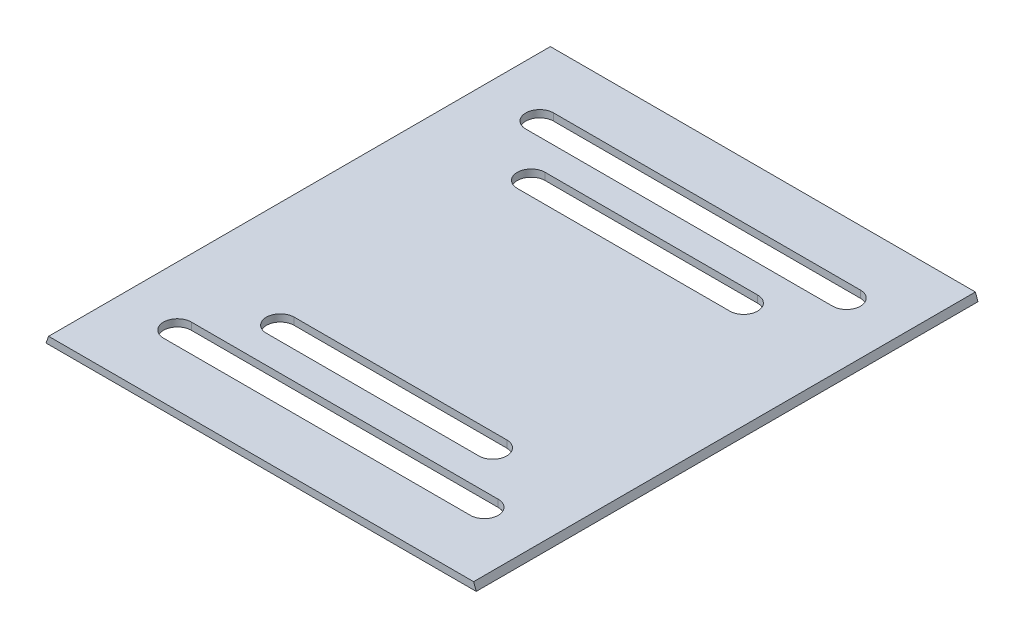
ISO-10303-21;
HEADER;
FILE_DESCRIPTION(('STEP AP214'),'2;1');
FILE_NAME('part.step','',(''),(''),'','','');
FILE_SCHEMA(('AUTOMOTIVE_DESIGN { 1 0 10303 214 1 1 1 1 }'));
ENDSEC;
DATA;
#1=APPLICATION_CONTEXT('core data for automotive mechanical design processes');
#2=APPLICATION_PROTOCOL_DEFINITION('international standard','automotive_design',2000,#1);
#3=PRODUCT_CONTEXT('',#1,'mechanical');
#4=PRODUCT('Part','Part','',(#3));
#5=PRODUCT_RELATED_PRODUCT_CATEGORY('part','',(#4));
#6=PRODUCT_DEFINITION_FORMATION('','',#4);
#7=PRODUCT_DEFINITION_CONTEXT('part definition',#1,'design');
#8=PRODUCT_DEFINITION('design','',#6,#7);
#9=PRODUCT_DEFINITION_SHAPE('','',#8);
#10=(LENGTH_UNIT() NAMED_UNIT(*) SI_UNIT(.MILLI.,.METRE.));
#11=(NAMED_UNIT(*) PLANE_ANGLE_UNIT() SI_UNIT($,.RADIAN.));
#12=(NAMED_UNIT(*) SI_UNIT($,.STERADIAN.) SOLID_ANGLE_UNIT());
#13=UNCERTAINTY_MEASURE_WITH_UNIT(LENGTH_MEASURE(1.E-05),#10,'distance_accuracy_value','');
#14=(GEOMETRIC_REPRESENTATION_CONTEXT(3) GLOBAL_UNCERTAINTY_ASSIGNED_CONTEXT((#13)) GLOBAL_UNIT_ASSIGNED_CONTEXT((#10,
#11,#12)) REPRESENTATION_CONTEXT('',''));
#15=CARTESIAN_POINT('',(0.,0.,0.));
#16=DIRECTION('',(0.,0.,1.));
#17=DIRECTION('',(1.,0.,0.));
#18=AXIS2_PLACEMENT_3D('',#15,#16,#17);
#19=CARTESIAN_POINT('',(-79.7671903582999,0.303723348595497,-180.));
#20=DIRECTION('',(0.,1.,0.));
#21=DIRECTION('',(-1.,0.,0.));
#22=AXIS2_PLACEMENT_3D('',#19,#20,#21);
#23=PLANE('',#22);
#24=CARTESIAN_POINT('',(51.5038134634531,0.303723348595498,-154.975433947444));
#25=DIRECTION('',(0.,1.,0.));
#26=DIRECTION('',(1.,0.,0.));
#27=AXIS2_PLACEMENT_3D('',#24,#25,#26);
#28=CIRCLE('',#27,5.);
#29=CARTESIAN_POINT('',(51.5038134634531,0.303723348595498,-149.975433947444));
#30=VERTEX_POINT('',#29);
#31=CARTESIAN_POINT('',(51.5038134634531,0.303723348595498,-159.975433947444));
#32=VERTEX_POINT('',#31);
#33=EDGE_CURVE('E55',#30,#32,#28,.T.);
#34=ORIENTED_EDGE('',*,*,#33,.F.);
#35=DIRECTION('',(1.,0.,0.));
#36=VECTOR('',#35,1.);
#37=CARTESIAN_POINT('',(-56.9956232695823,0.303723348595498,-149.975433947444));
#38=LINE('',#37,#36);
#39=CARTESIAN_POINT('',(-58.5702830662908,0.303723348595497,-149.975433947444));
#40=VERTEX_POINT('',#39);
#41=EDGE_CURVE('E199',#40,#30,#38,.T.);
#42=ORIENTED_EDGE('',*,*,#41,.F.);
#43=CARTESIAN_POINT('',(-58.5702830662908,0.303723348595497,-154.975433947444));
#44=DIRECTION('',(0.,1.,0.));
#45=DIRECTION('',(1.,0.,0.));
#46=AXIS2_PLACEMENT_3D('',#43,#44,#45);
#47=CIRCLE('',#46,5.);
#48=CARTESIAN_POINT('',(-58.5702830662908,0.303723348595497,-159.975433947444));
#49=VERTEX_POINT('',#48);
#50=EDGE_CURVE('E183',#49,#40,#47,.T.);
#51=ORIENTED_EDGE('',*,*,#50,.F.);
#52=DIRECTION('',(-1.,0.,0.));
#53=VECTOR('',#52,1.);
#54=CARTESIAN_POINT('',(-58.5702830662908,0.303723348595497,-159.975433947444));
#55=LINE('',#54,#53);
#56=EDGE_CURVE('E193',#32,#49,#55,.T.);
#57=ORIENTED_EDGE('',*,*,#56,.F.);
#58=EDGE_LOOP('',(#34,#42,#51,#57));
#59=FACE_BOUND('',#58,.T.);
#60=CARTESIAN_POINT('',(-41.6502125798594,0.303723348595498,-45.));
#61=DIRECTION('',(0.,1.,0.));
#62=DIRECTION('',(-1.,0.,0.));
#63=AXIS2_PLACEMENT_3D('',#60,#61,#62);
#64=CIRCLE('',#63,5.);
#65=CARTESIAN_POINT('',(-41.6502125798594,0.303723348595498,-50.));
#66=VERTEX_POINT('',#65);
#67=CARTESIAN_POINT('',(-41.6502125798594,0.303723348595498,-40.));
#68=VERTEX_POINT('',#67);
#69=EDGE_CURVE('E63',#66,#68,#64,.T.);
#70=ORIENTED_EDGE('',*,*,#69,.F.);
#71=DIRECTION('',(-1.,0.,0.));
#72=VECTOR('',#71,1.);
#73=CARTESIAN_POINT('',(-41.6502125798594,0.303723348595498,-50.));
#74=LINE('',#73,#72);
#75=CARTESIAN_POINT('',(34.5837429770217,0.303723348595498,-50.));
#76=VERTEX_POINT('',#75);
#77=EDGE_CURVE('E217',#76,#66,#74,.T.);
#78=ORIENTED_EDGE('',*,*,#77,.F.);
#79=CARTESIAN_POINT('',(34.5837429770217,0.303723348595498,-45.));
#80=DIRECTION('',(0.,1.,0.));
#81=DIRECTION('',(-1.,0.,0.));
#82=AXIS2_PLACEMENT_3D('',#79,#80,#81);
#83=CIRCLE('',#82,5.);
#84=CARTESIAN_POINT('',(34.5837429770217,0.303723348595498,-40.));
#85=VERTEX_POINT('',#84);
#86=EDGE_CURVE('E214',#85,#76,#83,.T.);
#87=ORIENTED_EDGE('',*,*,#86,.F.);
#88=DIRECTION('',(1.,0.,0.));
#89=VECTOR('',#88,1.);
#90=CARTESIAN_POINT('',(-41.6502125798594,0.303723348595498,-40.));
#91=LINE('',#90,#89);
#92=EDGE_CURVE('E210',#68,#85,#91,.T.);
#93=ORIENTED_EDGE('',*,*,#92,.F.);
#94=EDGE_LOOP('',(#70,#78,#87,#93));
#95=FACE_BOUND('',#94,.T.);
#96=DIRECTION('',(-1.,0.,0.));
#97=VECTOR('',#96,1.);
#98=CARTESIAN_POINT('',(-56.9956232695823,0.303723348595498,-30.0245660525564));
#99=LINE('',#98,#97);
#100=CARTESIAN_POINT('',(51.5038134634531,0.303723348595498,-30.0245660525564));
#101=VERTEX_POINT('',#100);
#102=CARTESIAN_POINT('',(-58.5702830662908,0.303723348595498,-30.0245660525564));
#103=VERTEX_POINT('',#102);
#104=EDGE_CURVE('E238',#101,#103,#99,.T.);
#105=ORIENTED_EDGE('',*,*,#104,.F.);
#106=CARTESIAN_POINT('',(51.5038134634531,0.303723348595498,-25.0245660525564));
#107=DIRECTION('',(0.,1.,0.));
#108=DIRECTION('',(-1.,0.,0.));
#109=AXIS2_PLACEMENT_3D('',#106,#107,#108);
#110=CIRCLE('',#109,5.);
#111=CARTESIAN_POINT('',(51.5038134634531,0.303723348595498,-20.0245660525564));
#112=VERTEX_POINT('',#111);
#113=EDGE_CURVE('E235',#112,#101,#110,.T.);
#114=ORIENTED_EDGE('',*,*,#113,.F.);
#115=DIRECTION('',(1.,0.,0.));
#116=VECTOR('',#115,1.);
#117=CARTESIAN_POINT('',(-58.5702830662908,0.303723348595497,-20.0245660525564));
#118=LINE('',#117,#116);
#119=CARTESIAN_POINT('',(-58.5702830662908,0.303723348595497,-20.0245660525564));
#120=VERTEX_POINT('',#119);
#121=EDGE_CURVE('E231',#120,#112,#118,.T.);
#122=ORIENTED_EDGE('',*,*,#121,.F.);
#123=CARTESIAN_POINT('',(-58.5702830662908,0.303723348595497,-25.0245660525564));
#124=DIRECTION('',(0.,1.,0.));
#125=DIRECTION('',(-1.,0.,0.));
#126=AXIS2_PLACEMENT_3D('',#123,#124,#125);
#127=CIRCLE('',#126,5.);
#128=EDGE_CURVE('E228',#103,#120,#127,.T.);
#129=ORIENTED_EDGE('',*,*,#128,.F.);
#130=EDGE_LOOP('',(#105,#114,#122,#129));
#131=FACE_BOUND('',#130,.T.);
#132=CARTESIAN_POINT('',(34.5837429770217,0.303723348595498,-135.));
#133=DIRECTION('',(0.,1.,0.));
#134=DIRECTION('',(1.,0.,0.));
#135=AXIS2_PLACEMENT_3D('',#132,#133,#134);
#136=CIRCLE('',#135,5.);
#137=CARTESIAN_POINT('',(34.5837429770217,0.303723348595498,-130.));
#138=VERTEX_POINT('',#137);
#139=CARTESIAN_POINT('',(34.5837429770217,0.303723348595498,-140.));
#140=VERTEX_POINT('',#139);
#141=EDGE_CURVE('E248',#138,#140,#136,.T.);
#142=ORIENTED_EDGE('',*,*,#141,.F.);
#143=DIRECTION('',(1.,0.,0.));
#144=VECTOR('',#143,1.);
#145=CARTESIAN_POINT('',(-41.6502125798594,0.303723348595498,-130.));
#146=LINE('',#145,#144);
#147=CARTESIAN_POINT('',(-41.6502125798594,0.303723348595498,-130.));
#148=VERTEX_POINT('',#147);
#149=EDGE_CURVE('E256',#148,#138,#146,.T.);
#150=ORIENTED_EDGE('',*,*,#149,.F.);
#151=CARTESIAN_POINT('',(-41.6502125798594,0.303723348595498,-135.));
#152=DIRECTION('',(0.,1.,0.));
#153=DIRECTION('',(1.,0.,0.));
#154=AXIS2_PLACEMENT_3D('',#151,#152,#153);
#155=CIRCLE('',#154,4.99999999999999);
#156=CARTESIAN_POINT('',(-41.6502125798594,0.303723348595498,-140.));
#157=VERTEX_POINT('',#156);
#158=EDGE_CURVE('E253',#157,#148,#155,.T.);
#159=ORIENTED_EDGE('',*,*,#158,.F.);
#160=DIRECTION('',(-1.,0.,0.));
#161=VECTOR('',#160,1.);
#162=CARTESIAN_POINT('',(-41.6502125798594,0.303723348595498,-140.));
#163=LINE('',#162,#161);
#164=EDGE_CURVE('E250',#140,#157,#163,.T.);
#165=ORIENTED_EDGE('',*,*,#164,.F.);
#166=EDGE_LOOP('',(#142,#150,#159,#165));
#167=FACE_BOUND('',#166,.T.);
#168=DIRECTION('',(-1.,0.,0.));
#169=VECTOR('',#168,1.);
#170=CARTESIAN_POINT('',(-79.7671903582999,0.303723348595497,0.));
#171=LINE('',#170,#169);
#172=CARTESIAN_POINT('',(72.7007207554622,0.303723348595498,0.));
#173=VERTEX_POINT('',#172);
#174=CARTESIAN_POINT('',(-79.7671903582999,0.303723348595497,0.));
#175=VERTEX_POINT('',#174);
#176=EDGE_CURVE('E270',#173,#175,#171,.T.);
#177=ORIENTED_EDGE('',*,*,#176,.F.);
#178=DIRECTION('',(0.,0.,1.));
#179=VECTOR('',#178,1.);
#180=CARTESIAN_POINT('',(72.7007207554622,0.303723348595498,-180.));
#181=LINE('',#180,#179);
#182=CARTESIAN_POINT('',(72.7007207554622,0.303723348595498,-180.));
#183=VERTEX_POINT('',#182);
#184=EDGE_CURVE('E292',#183,#173,#181,.T.);
#185=ORIENTED_EDGE('',*,*,#184,.F.);
#186=DIRECTION('',(-1.,0.,0.));
#187=VECTOR('',#186,1.);
#188=CARTESIAN_POINT('',(72.7007207554622,0.303723348595498,-180.));
#189=LINE('',#188,#187);
#190=CARTESIAN_POINT('',(-79.7671903582999,0.303723348595497,-180.));
#191=VERTEX_POINT('',#190);
#192=EDGE_CURVE('E275',#183,#191,#189,.T.);
#193=ORIENTED_EDGE('',*,*,#192,.T.);
#194=DIRECTION('',(0.,0.,1.));
#195=VECTOR('',#194,1.);
#196=CARTESIAN_POINT('',(-79.7671903582999,0.303723348595497,-180.));
#197=LINE('',#196,#195);
#198=EDGE_CURVE('E288',#191,#175,#197,.T.);
#199=ORIENTED_EDGE('',*,*,#198,.T.);
#200=EDGE_LOOP('',(#177,#185,#193,#199));
#201=FACE_BOUND('',#200,.T.);
#202=ADVANCED_FACE('F40',(#59,#95,#131,#167,#201),#23,.T.);
#203=CARTESIAN_POINT('',(72.7318420433847,0.218218312764078,-180.));
#204=DIRECTION('',(0.939692620785915,0.34202014332565,0.));
#205=DIRECTION('',(-0.34202014332565,0.939692620785915,0.));
#206=AXIS2_PLACEMENT_3D('',#203,#204,#205);
#207=PLANE('',#206);
#208=DIRECTION('',(-0.34202014332565,0.939692620785915,0.));
#209=VECTOR('',#208,1.);
#210=CARTESIAN_POINT('',(72.7318420433847,0.218218312764078,0.));
#211=LINE('',#210,#209);
#212=CARTESIAN_POINT('',(73.6357886268726,-2.26535451376221,0.));
#213=VERTEX_POINT('',#212);
#214=EDGE_CURVE('E283',#213,#173,#211,.T.);
#215=ORIENTED_EDGE('',*,*,#214,.F.);
#216=DIRECTION('',(0.,0.,1.));
#217=VECTOR('',#216,1.);
#218=CARTESIAN_POINT('',(73.6357886268726,-2.26535451376221,-180.));
#219=LINE('',#218,#217);
#220=CARTESIAN_POINT('',(73.6357886268726,-2.26535451376221,-180.));
#221=VERTEX_POINT('',#220);
#222=EDGE_CURVE('E295',#221,#213,#219,.T.);
#223=ORIENTED_EDGE('',*,*,#222,.F.);
#224=DIRECTION('',(-0.342020143325681,0.939692620785904,0.));
#225=VECTOR('',#224,1.);
#226=CARTESIAN_POINT('',(73.6357886268726,-2.26535451376221,-180.));
#227=LINE('',#226,#225);
#228=EDGE_CURVE('E273',#221,#183,#227,.T.);
#229=ORIENTED_EDGE('',*,*,#228,.T.);
#230=ORIENTED_EDGE('',*,*,#184,.T.);
#231=EDGE_LOOP('',(#215,#223,#229,#230));
#232=FACE_BOUND('',#231,.T.);
#233=ADVANCED_FACE('F350',(#232),#207,.T.);
#234=CARTESIAN_POINT('',(-80.7022582297104,-2.26535451376221,-180.));
#235=DIRECTION('',(0.,-1.,0.));
#236=DIRECTION('',(0.,0.,-1.));
#237=AXIS2_PLACEMENT_3D('',#234,#235,#236);
#238=PLANE('',#237);
#239=CARTESIAN_POINT('',(51.5038134634531,-2.26535451376221,-154.975433947444));
#240=DIRECTION('',(0.,-1.,0.));
#241=DIRECTION('',(0.,0.,-1.));
#242=AXIS2_PLACEMENT_3D('',#239,#240,#241);
#243=CIRCLE('',#242,5.);
#244=CARTESIAN_POINT('',(51.5038134634531,-2.26535451376221,-159.975433947444));
#245=VERTEX_POINT('',#244);
#246=CARTESIAN_POINT('',(51.5038134634531,-2.26535451376221,-149.975433947444));
#247=VERTEX_POINT('',#246);
#248=EDGE_CURVE('E11',#245,#247,#243,.T.);
#249=ORIENTED_EDGE('',*,*,#248,.F.);
#250=DIRECTION('',(1.,0.,0.));
#251=VECTOR('',#250,1.);
#252=CARTESIAN_POINT('',(-80.7022582297104,-2.26535451376221,-159.975433947444));
#253=LINE('',#252,#251);
#254=CARTESIAN_POINT('',(-58.5702830662908,-2.26535451376221,-159.975433947444));
#255=VERTEX_POINT('',#254);
#256=EDGE_CURVE('E325',#255,#245,#253,.T.);
#257=ORIENTED_EDGE('',*,*,#256,.F.);
#258=CARTESIAN_POINT('',(-58.5702830662908,-2.26535451376221,-154.975433947444));
#259=DIRECTION('',(0.,-1.,0.));
#260=DIRECTION('',(0.,0.,-1.));
#261=AXIS2_PLACEMENT_3D('',#258,#259,#260);
#262=CIRCLE('',#261,5.);
#263=CARTESIAN_POINT('',(-58.5702830662908,-2.26535451376221,-149.975433947444));
#264=VERTEX_POINT('',#263);
#265=EDGE_CURVE('E186',#264,#255,#262,.T.);
#266=ORIENTED_EDGE('',*,*,#265,.F.);
#267=DIRECTION('',(-1.,0.,0.));
#268=VECTOR('',#267,1.);
#269=CARTESIAN_POINT('',(-80.7022582297104,-2.26535451376221,-149.975433947444));
#270=LINE('',#269,#268);
#271=EDGE_CURVE('E48',#247,#264,#270,.T.);
#272=ORIENTED_EDGE('',*,*,#271,.F.);
#273=EDGE_LOOP('',(#249,#257,#266,#272));
#274=FACE_BOUND('',#273,.T.);
#275=CARTESIAN_POINT('',(-41.6502125798594,-2.26535451376221,-45.));
#276=DIRECTION('',(0.,-1.,0.));
#277=DIRECTION('',(0.,0.,-1.));
#278=AXIS2_PLACEMENT_3D('',#275,#276,#277);
#279=CIRCLE('',#278,5.);
#280=CARTESIAN_POINT('',(-41.6502125798594,-2.26535451376221,-40.));
#281=VERTEX_POINT('',#280);
#282=CARTESIAN_POINT('',(-41.6502125798594,-2.26535451376221,-50.));
#283=VERTEX_POINT('',#282);
#284=EDGE_CURVE('E323',#281,#283,#279,.T.);
#285=ORIENTED_EDGE('',*,*,#284,.F.);
#286=DIRECTION('',(-1.,0.,0.));
#287=VECTOR('',#286,1.);
#288=CARTESIAN_POINT('',(-80.7022582297104,-2.26535451376221,-40.));
#289=LINE('',#288,#287);
#290=CARTESIAN_POINT('',(34.5837429770217,-2.26535451376221,-40.));
#291=VERTEX_POINT('',#290);
#292=EDGE_CURVE('E316',#291,#281,#289,.T.);
#293=ORIENTED_EDGE('',*,*,#292,.F.);
#294=CARTESIAN_POINT('',(34.5837429770217,-2.26535451376221,-45.));
#295=DIRECTION('',(0.,-1.,0.));
#296=DIRECTION('',(0.,0.,-1.));
#297=AXIS2_PLACEMENT_3D('',#294,#295,#296);
#298=CIRCLE('',#297,5.);
#299=CARTESIAN_POINT('',(34.5837429770217,-2.26535451376221,-50.));
#300=VERTEX_POINT('',#299);
#301=EDGE_CURVE('E318',#300,#291,#298,.T.);
#302=ORIENTED_EDGE('',*,*,#301,.F.);
#303=DIRECTION('',(1.,0.,0.));
#304=VECTOR('',#303,1.);
#305=CARTESIAN_POINT('',(-80.7022582297104,-2.26535451376221,-50.));
#306=LINE('',#305,#304);
#307=EDGE_CURVE('E321',#283,#300,#306,.T.);
#308=ORIENTED_EDGE('',*,*,#307,.F.);
#309=EDGE_LOOP('',(#285,#293,#302,#308));
#310=FACE_BOUND('',#309,.T.);
#311=DIRECTION('',(1.,0.,0.));
#312=VECTOR('',#311,1.);
#313=CARTESIAN_POINT('',(-80.7022582297104,-2.26535451376221,-30.0245660525564));
#314=LINE('',#313,#312);
#315=CARTESIAN_POINT('',(-58.5702830662908,-2.26535451376221,-30.0245660525564));
#316=VERTEX_POINT('',#315);
#317=CARTESIAN_POINT('',(51.5038134634531,-2.26535451376221,-30.0245660525564));
#318=VERTEX_POINT('',#317);
#319=EDGE_CURVE('E314',#316,#318,#314,.T.);
#320=ORIENTED_EDGE('',*,*,#319,.F.);
#321=CARTESIAN_POINT('',(-58.5702830662908,-2.26535451376221,-25.0245660525564));
#322=DIRECTION('',(0.,-1.,0.));
#323=DIRECTION('',(0.,0.,-1.));
#324=AXIS2_PLACEMENT_3D('',#321,#322,#323);
#325=CIRCLE('',#324,5.);
#326=CARTESIAN_POINT('',(-58.5702830662908,-2.26535451376221,-20.0245660525564));
#327=VERTEX_POINT('',#326);
#328=EDGE_CURVE('E307',#327,#316,#325,.T.);
#329=ORIENTED_EDGE('',*,*,#328,.F.);
#330=DIRECTION('',(-1.,0.,0.));
#331=VECTOR('',#330,1.);
#332=CARTESIAN_POINT('',(-80.7022582297104,-2.26535451376221,-20.0245660525564));
#333=LINE('',#332,#331);
#334=CARTESIAN_POINT('',(51.5038134634531,-2.26535451376221,-20.0245660525564));
#335=VERTEX_POINT('',#334);
#336=EDGE_CURVE('E309',#335,#327,#333,.T.);
#337=ORIENTED_EDGE('',*,*,#336,.F.);
#338=CARTESIAN_POINT('',(51.5038134634531,-2.26535451376221,-25.0245660525564));
#339=DIRECTION('',(0.,-1.,0.));
#340=DIRECTION('',(0.,0.,-1.));
#341=AXIS2_PLACEMENT_3D('',#338,#339,#340);
#342=CIRCLE('',#341,5.);
#343=EDGE_CURVE('E312',#318,#335,#342,.T.);
#344=ORIENTED_EDGE('',*,*,#343,.F.);
#345=EDGE_LOOP('',(#320,#329,#337,#344));
#346=FACE_BOUND('',#345,.T.);
#347=CARTESIAN_POINT('',(34.5837429770217,-2.26535451376221,-135.));
#348=DIRECTION('',(0.,-1.,0.));
#349=DIRECTION('',(0.,0.,-1.));
#350=AXIS2_PLACEMENT_3D('',#347,#348,#349);
#351=CIRCLE('',#350,5.);
#352=CARTESIAN_POINT('',(34.5837429770217,-2.26535451376221,-140.));
#353=VERTEX_POINT('',#352);
#354=CARTESIAN_POINT('',(34.5837429770217,-2.26535451376221,-130.));
#355=VERTEX_POINT('',#354);
#356=EDGE_CURVE('E305',#353,#355,#351,.T.);
#357=ORIENTED_EDGE('',*,*,#356,.F.);
#358=DIRECTION('',(1.,0.,0.));
#359=VECTOR('',#358,1.);
#360=CARTESIAN_POINT('',(-80.7022582297104,-2.26535451376221,-140.));
#361=LINE('',#360,#359);
#362=CARTESIAN_POINT('',(-41.6502125798594,-2.26535451376221,-140.));
#363=VERTEX_POINT('',#362);
#364=EDGE_CURVE('E291',#363,#353,#361,.T.);
#365=ORIENTED_EDGE('',*,*,#364,.F.);
#366=CARTESIAN_POINT('',(-41.6502125798594,-2.26535451376221,-135.));
#367=DIRECTION('',(0.,-1.,0.));
#368=DIRECTION('',(0.,0.,-1.));
#369=AXIS2_PLACEMENT_3D('',#366,#367,#368);
#370=CIRCLE('',#369,4.99999999999999);
#371=CARTESIAN_POINT('',(-41.6502125798594,-2.26535451376221,-130.));
#372=VERTEX_POINT('',#371);
#373=EDGE_CURVE('E300',#372,#363,#370,.T.);
#374=ORIENTED_EDGE('',*,*,#373,.F.);
#375=DIRECTION('',(-1.,0.,0.));
#376=VECTOR('',#375,1.);
#377=CARTESIAN_POINT('',(-80.7022582297104,-2.26535451376221,-130.));
#378=LINE('',#377,#376);
#379=EDGE_CURVE('E303',#355,#372,#378,.T.);
#380=ORIENTED_EDGE('',*,*,#379,.F.);
#381=EDGE_LOOP('',(#357,#365,#374,#380));
#382=FACE_BOUND('',#381,.T.);
#383=DIRECTION('',(1.,0.,0.));
#384=VECTOR('',#383,1.);
#385=CARTESIAN_POINT('',(-80.7022582297104,-2.26535451376221,0.));
#386=LINE('',#385,#384);
#387=CARTESIAN_POINT('',(-80.7022582297104,-2.26535451376221,0.));
#388=VERTEX_POINT('',#387);
#389=EDGE_CURVE('E280',#388,#213,#386,.T.);
#390=ORIENTED_EDGE('',*,*,#389,.F.);
#391=DIRECTION('',(0.,0.,1.));
#392=VECTOR('',#391,1.);
#393=CARTESIAN_POINT('',(-80.7022582297104,-2.26535451376221,-180.));
#394=LINE('',#393,#392);
#395=CARTESIAN_POINT('',(-80.7022582297104,-2.26535451376221,-180.));
#396=VERTEX_POINT('',#395);
#397=EDGE_CURVE('E277',#396,#388,#394,.T.);
#398=ORIENTED_EDGE('',*,*,#397,.F.);
#399=DIRECTION('',(1.,0.,0.));
#400=VECTOR('',#399,1.);
#401=CARTESIAN_POINT('',(-80.7022582297104,-2.26535451376221,-180.));
#402=LINE('',#401,#400);
#403=EDGE_CURVE('E269',#396,#221,#402,.T.);
#404=ORIENTED_EDGE('',*,*,#403,.T.);
#405=ORIENTED_EDGE('',*,*,#222,.T.);
#406=EDGE_LOOP('',(#390,#398,#404,#405));
#407=FACE_BOUND('',#406,.T.);
#408=ADVANCED_FACE('F333',(#274,#310,#346,#382,#407),#238,.T.);
#409=CARTESIAN_POINT('',(-79.7983116462224,0.218218312764078,-180.));
#410=DIRECTION('',(-0.939692620785904,0.342020143325681,0.));
#411=DIRECTION('',(-0.342020143325681,-0.939692620785904,0.));
#412=AXIS2_PLACEMENT_3D('',#409,#410,#411);
#413=PLANE('',#412);
#414=DIRECTION('',(-0.342020143325681,-0.939692620785904,0.));
#415=VECTOR('',#414,1.);
#416=CARTESIAN_POINT('',(-79.7983116462224,0.218218312764078,0.));
#417=LINE('',#416,#415);
#418=EDGE_CURVE('E206',#175,#388,#417,.T.);
#419=ORIENTED_EDGE('',*,*,#418,.F.);
#420=ORIENTED_EDGE('',*,*,#198,.F.);
#421=DIRECTION('',(-0.342020143325789,-0.939692620785865,0.));
#422=VECTOR('',#421,1.);
#423=CARTESIAN_POINT('',(-79.7983116462224,0.218218312764078,-180.));
#424=LINE('',#423,#422);
#425=EDGE_CURVE('E267',#191,#396,#424,.T.);
#426=ORIENTED_EDGE('',*,*,#425,.T.);
#427=ORIENTED_EDGE('',*,*,#397,.T.);
#428=EDGE_LOOP('',(#419,#420,#426,#427));
#429=FACE_BOUND('',#428,.T.);
#430=ADVANCED_FACE('F42',(#429),#413,.T.);
#431=CARTESIAN_POINT('',(0.,0.,-180.));
#432=DIRECTION('',(0.,0.,-1.));
#433=DIRECTION('',(-1.,0.,0.));
#434=AXIS2_PLACEMENT_3D('',#431,#432,#433);
#435=PLANE('',#434);
#436=ORIENTED_EDGE('',*,*,#425,.F.);
#437=ORIENTED_EDGE('',*,*,#192,.F.);
#438=ORIENTED_EDGE('',*,*,#228,.F.);
#439=ORIENTED_EDGE('',*,*,#403,.F.);
#440=EDGE_LOOP('',(#436,#437,#438,#439));
#441=FACE_BOUND('',#440,.T.);
#442=ADVANCED_FACE('F364',(#441),#435,.T.);
#443=CARTESIAN_POINT('',(0.,0.,0.));
#444=DIRECTION('',(0.,0.,-1.));
#445=DIRECTION('',(-1.,0.,0.));
#446=AXIS2_PLACEMENT_3D('',#443,#444,#445);
#447=PLANE('',#446);
#448=ORIENTED_EDGE('',*,*,#176,.T.);
#449=ORIENTED_EDGE('',*,*,#418,.T.);
#450=ORIENTED_EDGE('',*,*,#389,.T.);
#451=ORIENTED_EDGE('',*,*,#214,.T.);
#452=EDGE_LOOP('',(#448,#449,#450,#451));
#453=FACE_BOUND('',#452,.T.);
#454=ADVANCED_FACE('F358',(#453),#447,.F.);
#455=CARTESIAN_POINT('',(34.5837429770217,-2.6962766514045,-135.));
#456=DIRECTION('',(0.,1.,0.));
#457=DIRECTION('',(-1.,0.,0.));
#458=AXIS2_PLACEMENT_3D('',#455,#456,#457);
#459=CYLINDRICAL_SURFACE('',#458,5.);
#460=ORIENTED_EDGE('',*,*,#356,.T.);
#461=DIRECTION('',(0.,1.,0.));
#462=VECTOR('',#461,1.);
#463=CARTESIAN_POINT('',(34.5837429770217,-2.6962766514045,-130.));
#464=LINE('',#463,#462);
#465=EDGE_CURVE('E232',#355,#138,#464,.T.);
#466=ORIENTED_EDGE('',*,*,#465,.T.);
#467=ORIENTED_EDGE('',*,*,#141,.T.);
#468=DIRECTION('',(0.,1.,0.));
#469=VECTOR('',#468,1.);
#470=CARTESIAN_POINT('',(34.5837429770217,-2.6962766514045,-140.));
#471=LINE('',#470,#469);
#472=EDGE_CURVE('E259',#353,#140,#471,.T.);
#473=ORIENTED_EDGE('',*,*,#472,.F.);
#474=EDGE_LOOP('',(#460,#466,#467,#473));
#475=FACE_BOUND('',#474,.T.);
#476=ADVANCED_FACE('F382',(#475),#459,.F.);
#477=CARTESIAN_POINT('',(-41.6502125798594,-2.6962766514045,-130.));
#478=DIRECTION('',(0.,0.,1.));
#479=DIRECTION('',(1.,0.,0.));
#480=AXIS2_PLACEMENT_3D('',#477,#478,#479);
#481=PLANE('',#480);
#482=ORIENTED_EDGE('',*,*,#379,.T.);
#483=DIRECTION('',(0.,1.,0.));
#484=VECTOR('',#483,1.);
#485=CARTESIAN_POINT('',(-41.6502125798594,-2.6962766514045,-130.));
#486=LINE('',#485,#484);
#487=EDGE_CURVE('E261',#372,#148,#486,.T.);
#488=ORIENTED_EDGE('',*,*,#487,.T.);
#489=ORIENTED_EDGE('',*,*,#149,.T.);
#490=ORIENTED_EDGE('',*,*,#465,.F.);
#491=EDGE_LOOP('',(#482,#488,#489,#490));
#492=FACE_BOUND('',#491,.T.);
#493=ADVANCED_FACE('F386',(#492),#481,.F.);
#494=CARTESIAN_POINT('',(-41.6502125798594,-2.6962766514045,-135.));
#495=DIRECTION('',(0.,1.,0.));
#496=DIRECTION('',(-1.,0.,0.));
#497=AXIS2_PLACEMENT_3D('',#494,#495,#496);
#498=CYLINDRICAL_SURFACE('',#497,4.99999999999999);
#499=ORIENTED_EDGE('',*,*,#373,.T.);
#500=DIRECTION('',(0.,1.,0.));
#501=VECTOR('',#500,1.);
#502=CARTESIAN_POINT('',(-41.6502125798594,-2.6962766514045,-140.));
#503=LINE('',#502,#501);
#504=EDGE_CURVE('E263',#363,#157,#503,.T.);
#505=ORIENTED_EDGE('',*,*,#504,.T.);
#506=ORIENTED_EDGE('',*,*,#158,.T.);
#507=ORIENTED_EDGE('',*,*,#487,.F.);
#508=EDGE_LOOP('',(#499,#505,#506,#507));
#509=FACE_BOUND('',#508,.T.);
#510=ADVANCED_FACE('F392',(#509),#498,.F.);
#511=CARTESIAN_POINT('',(-41.6502125798594,-2.6962766514045,-140.));
#512=DIRECTION('',(0.,0.,-1.));
#513=DIRECTION('',(-1.,0.,0.));
#514=AXIS2_PLACEMENT_3D('',#511,#512,#513);
#515=PLANE('',#514);
#516=ORIENTED_EDGE('',*,*,#364,.T.);
#517=ORIENTED_EDGE('',*,*,#472,.T.);
#518=ORIENTED_EDGE('',*,*,#164,.T.);
#519=ORIENTED_EDGE('',*,*,#504,.F.);
#520=EDGE_LOOP('',(#516,#517,#518,#519));
#521=FACE_BOUND('',#520,.T.);
#522=ADVANCED_FACE('F396',(#521),#515,.F.);
#523=CARTESIAN_POINT('',(-56.9956232695823,-2.6962766514045,-30.0245660525564));
#524=DIRECTION('',(0.,0.,-1.));
#525=DIRECTION('',(-1.,0.,0.));
#526=AXIS2_PLACEMENT_3D('',#523,#524,#525);
#527=PLANE('',#526);
#528=ORIENTED_EDGE('',*,*,#319,.T.);
#529=DIRECTION('',(0.,1.,0.));
#530=VECTOR('',#529,1.);
#531=CARTESIAN_POINT('',(51.5038134634531,-2.6962766514045,-30.0245660525564));
#532=LINE('',#531,#530);
#533=EDGE_CURVE('E211',#318,#101,#532,.T.);
#534=ORIENTED_EDGE('',*,*,#533,.T.);
#535=ORIENTED_EDGE('',*,*,#104,.T.);
#536=DIRECTION('',(0.,1.,0.));
#537=VECTOR('',#536,1.);
#538=CARTESIAN_POINT('',(-58.5702830662908,-2.6962766514045,-30.0245660525564));
#539=LINE('',#538,#537);
#540=EDGE_CURVE('E240',#316,#103,#539,.T.);
#541=ORIENTED_EDGE('',*,*,#540,.F.);
#542=EDGE_LOOP('',(#528,#534,#535,#541));
#543=FACE_BOUND('',#542,.T.);
#544=ADVANCED_FACE('F399',(#543),#527,.F.);
#545=CARTESIAN_POINT('',(51.5038134634531,-2.6962766514045,-25.0245660525564));
#546=DIRECTION('',(0.,1.,0.));
#547=DIRECTION('',(-1.,0.,0.));
#548=AXIS2_PLACEMENT_3D('',#545,#546,#547);
#549=CYLINDRICAL_SURFACE('',#548,5.);
#550=ORIENTED_EDGE('',*,*,#343,.T.);
#551=DIRECTION('',(0.,1.,0.));
#552=VECTOR('',#551,1.);
#553=CARTESIAN_POINT('',(51.5038134634531,-2.6962766514045,-20.0245660525564));
#554=LINE('',#553,#552);
#555=EDGE_CURVE('E242',#335,#112,#554,.T.);
#556=ORIENTED_EDGE('',*,*,#555,.T.);
#557=ORIENTED_EDGE('',*,*,#113,.T.);
#558=ORIENTED_EDGE('',*,*,#533,.F.);
#559=EDGE_LOOP('',(#550,#556,#557,#558));
#560=FACE_BOUND('',#559,.T.);
#561=ADVANCED_FACE('F412',(#560),#549,.F.);
#562=CARTESIAN_POINT('',(-58.5702830662908,-2.6962766514045,-20.0245660525564));
#563=DIRECTION('',(0.,0.,1.));
#564=DIRECTION('',(1.,0.,0.));
#565=AXIS2_PLACEMENT_3D('',#562,#563,#564);
#566=PLANE('',#565);
#567=ORIENTED_EDGE('',*,*,#336,.T.);
#568=DIRECTION('',(0.,1.,0.));
#569=VECTOR('',#568,1.);
#570=CARTESIAN_POINT('',(-58.5702830662908,-2.6962766514045,-20.0245660525564));
#571=LINE('',#570,#569);
#572=EDGE_CURVE('E244',#327,#120,#571,.T.);
#573=ORIENTED_EDGE('',*,*,#572,.T.);
#574=ORIENTED_EDGE('',*,*,#121,.T.);
#575=ORIENTED_EDGE('',*,*,#555,.F.);
#576=EDGE_LOOP('',(#567,#573,#574,#575));
#577=FACE_BOUND('',#576,.T.);
#578=ADVANCED_FACE('F408',(#577),#566,.F.);
#579=CARTESIAN_POINT('',(-58.5702830662908,-2.6962766514045,-25.0245660525564));
#580=DIRECTION('',(0.,1.,0.));
#581=DIRECTION('',(-1.,0.,0.));
#582=AXIS2_PLACEMENT_3D('',#579,#580,#581);
#583=CYLINDRICAL_SURFACE('',#582,5.);
#584=ORIENTED_EDGE('',*,*,#328,.T.);
#585=ORIENTED_EDGE('',*,*,#540,.T.);
#586=ORIENTED_EDGE('',*,*,#128,.T.);
#587=ORIENTED_EDGE('',*,*,#572,.F.);
#588=EDGE_LOOP('',(#584,#585,#586,#587));
#589=FACE_BOUND('',#588,.T.);
#590=ADVANCED_FACE('F404',(#589),#583,.F.);
#591=CARTESIAN_POINT('',(-41.6502125798594,-2.6962766514045,-45.));
#592=DIRECTION('',(0.,1.,0.));
#593=DIRECTION('',(-1.,0.,0.));
#594=AXIS2_PLACEMENT_3D('',#591,#592,#593);
#595=CYLINDRICAL_SURFACE('',#594,5.);
#596=ORIENTED_EDGE('',*,*,#284,.T.);
#597=DIRECTION('',(0.,1.,0.));
#598=VECTOR('',#597,1.);
#599=CARTESIAN_POINT('',(-41.6502125798594,-2.6962766514045,-50.));
#600=LINE('',#599,#598);
#601=EDGE_CURVE('E221',#283,#66,#600,.T.);
#602=ORIENTED_EDGE('',*,*,#601,.T.);
#603=ORIENTED_EDGE('',*,*,#69,.T.);
#604=DIRECTION('',(0.,1.,0.));
#605=VECTOR('',#604,1.);
#606=CARTESIAN_POINT('',(-41.6502125798594,-2.6962766514045,-40.));
#607=LINE('',#606,#605);
#608=EDGE_CURVE('E220',#281,#68,#607,.T.);
#609=ORIENTED_EDGE('',*,*,#608,.F.);
#610=EDGE_LOOP('',(#596,#602,#603,#609));
#611=FACE_BOUND('',#610,.T.);
#612=ADVANCED_FACE('F407',(#611),#595,.F.);
#613=CARTESIAN_POINT('',(-41.6502125798594,-2.6962766514045,-50.));
#614=DIRECTION('',(0.,0.,-1.));
#615=DIRECTION('',(-1.,0.,0.));
#616=AXIS2_PLACEMENT_3D('',#613,#614,#615);
#617=PLANE('',#616);
#618=ORIENTED_EDGE('',*,*,#307,.T.);
#619=DIRECTION('',(0.,1.,0.));
#620=VECTOR('',#619,1.);
#621=CARTESIAN_POINT('',(34.5837429770217,-2.6962766514045,-50.));
#622=LINE('',#621,#620);
#623=EDGE_CURVE('E223',#300,#76,#622,.T.);
#624=ORIENTED_EDGE('',*,*,#623,.T.);
#625=ORIENTED_EDGE('',*,*,#77,.T.);
#626=ORIENTED_EDGE('',*,*,#601,.F.);
#627=EDGE_LOOP('',(#618,#624,#625,#626));
#628=FACE_BOUND('',#627,.T.);
#629=ADVANCED_FACE('F421',(#628),#617,.F.);
#630=CARTESIAN_POINT('',(34.5837429770217,-2.6962766514045,-45.));
#631=DIRECTION('',(0.,1.,0.));
#632=DIRECTION('',(-1.,0.,0.));
#633=AXIS2_PLACEMENT_3D('',#630,#631,#632);
#634=CYLINDRICAL_SURFACE('',#633,5.);
#635=ORIENTED_EDGE('',*,*,#301,.T.);
#636=DIRECTION('',(0.,1.,0.));
#637=VECTOR('',#636,1.);
#638=CARTESIAN_POINT('',(34.5837429770217,-2.6962766514045,-40.));
#639=LINE('',#638,#637);
#640=EDGE_CURVE('E225',#291,#85,#639,.T.);
#641=ORIENTED_EDGE('',*,*,#640,.T.);
#642=ORIENTED_EDGE('',*,*,#86,.T.);
#643=ORIENTED_EDGE('',*,*,#623,.F.);
#644=EDGE_LOOP('',(#635,#641,#642,#643));
#645=FACE_BOUND('',#644,.T.);
#646=ADVANCED_FACE('F344',(#645),#634,.F.);
#647=CARTESIAN_POINT('',(-41.6502125798594,-2.6962766514045,-40.));
#648=DIRECTION('',(0.,0.,1.));
#649=DIRECTION('',(1.,0.,0.));
#650=AXIS2_PLACEMENT_3D('',#647,#648,#649);
#651=PLANE('',#650);
#652=ORIENTED_EDGE('',*,*,#292,.T.);
#653=ORIENTED_EDGE('',*,*,#608,.T.);
#654=ORIENTED_EDGE('',*,*,#92,.T.);
#655=ORIENTED_EDGE('',*,*,#640,.F.);
#656=EDGE_LOOP('',(#652,#653,#654,#655));
#657=FACE_BOUND('',#656,.T.);
#658=ADVANCED_FACE('F337',(#657),#651,.F.);
#659=CARTESIAN_POINT('',(51.5038134634531,-2.6962766514045,-154.975433947444));
#660=DIRECTION('',(0.,1.,0.));
#661=DIRECTION('',(-1.,0.,0.));
#662=AXIS2_PLACEMENT_3D('',#659,#660,#661);
#663=CYLINDRICAL_SURFACE('',#662,5.);
#664=ORIENTED_EDGE('',*,*,#248,.T.);
#665=DIRECTION('',(0.,1.,0.));
#666=VECTOR('',#665,1.);
#667=CARTESIAN_POINT('',(51.5038134634531,-2.6962766514045,-149.975433947444));
#668=LINE('',#667,#666);
#669=EDGE_CURVE('E204',#247,#30,#668,.T.);
#670=ORIENTED_EDGE('',*,*,#669,.T.);
#671=ORIENTED_EDGE('',*,*,#33,.T.);
#672=DIRECTION('',(0.,1.,0.));
#673=VECTOR('',#672,1.);
#674=CARTESIAN_POINT('',(51.5038134634531,-2.6962766514045,-159.975433947444));
#675=LINE('',#674,#673);
#676=EDGE_CURVE('E190',#245,#32,#675,.T.);
#677=ORIENTED_EDGE('',*,*,#676,.F.);
#678=EDGE_LOOP('',(#664,#670,#671,#677));
#679=FACE_BOUND('',#678,.T.);
#680=ADVANCED_FACE('F335',(#679),#663,.F.);
#681=CARTESIAN_POINT('',(-56.9956232695823,-2.6962766514045,-149.975433947444));
#682=DIRECTION('',(0.,0.,1.));
#683=DIRECTION('',(1.,0.,0.));
#684=AXIS2_PLACEMENT_3D('',#681,#682,#683);
#685=PLANE('',#684);
#686=ORIENTED_EDGE('',*,*,#271,.T.);
#687=DIRECTION('',(0.,1.,0.));
#688=VECTOR('',#687,1.);
#689=CARTESIAN_POINT('',(-58.5702830662908,-2.6962766514045,-149.975433947444));
#690=LINE('',#689,#688);
#691=EDGE_CURVE('E189',#264,#40,#690,.T.);
#692=ORIENTED_EDGE('',*,*,#691,.T.);
#693=ORIENTED_EDGE('',*,*,#41,.T.);
#694=ORIENTED_EDGE('',*,*,#669,.F.);
#695=EDGE_LOOP('',(#686,#692,#693,#694));
#696=FACE_BOUND('',#695,.T.);
#697=ADVANCED_FACE('F330',(#696),#685,.F.);
#698=CARTESIAN_POINT('',(-58.5702830662908,-2.6962766514045,-154.975433947444));
#699=DIRECTION('',(0.,1.,0.));
#700=DIRECTION('',(-1.,0.,0.));
#701=AXIS2_PLACEMENT_3D('',#698,#699,#700);
#702=CYLINDRICAL_SURFACE('',#701,5.);
#703=ORIENTED_EDGE('',*,*,#265,.T.);
#704=DIRECTION('',(0.,1.,0.));
#705=VECTOR('',#704,1.);
#706=CARTESIAN_POINT('',(-58.5702830662908,-2.6962766514045,-159.975433947444));
#707=LINE('',#706,#705);
#708=EDGE_CURVE('E178',#255,#49,#707,.T.);
#709=ORIENTED_EDGE('',*,*,#708,.T.);
#710=ORIENTED_EDGE('',*,*,#50,.T.);
#711=ORIENTED_EDGE('',*,*,#691,.F.);
#712=EDGE_LOOP('',(#703,#709,#710,#711));
#713=FACE_BOUND('',#712,.T.);
#714=ADVANCED_FACE('F180',(#713),#702,.F.);
#715=CARTESIAN_POINT('',(-58.5702830662908,-2.6962766514045,-159.975433947444));
#716=DIRECTION('',(0.,0.,-1.));
#717=DIRECTION('',(-1.,0.,0.));
#718=AXIS2_PLACEMENT_3D('',#715,#716,#717);
#719=PLANE('',#718);
#720=ORIENTED_EDGE('',*,*,#256,.T.);
#721=ORIENTED_EDGE('',*,*,#676,.T.);
#722=ORIENTED_EDGE('',*,*,#56,.T.);
#723=ORIENTED_EDGE('',*,*,#708,.F.);
#724=EDGE_LOOP('',(#720,#721,#722,#723));
#725=FACE_BOUND('',#724,.T.);
#726=ADVANCED_FACE('F194',(#725),#719,.F.);
#727=CLOSED_SHELL('',(#202,#233,#408,#430,#442,#454,#476,#493,#510,#522,#544,#561,#578,#590,
#612,#629,#646,#658,#680,#697,#714,#726));
#728=MANIFOLD_SOLID_BREP('B2',#727);
#729=ADVANCED_BREP_SHAPE_REPRESENTATION('',(#18,#728),#14);
#730=SHAPE_DEFINITION_REPRESENTATION(#9,#729);
ENDSEC;
END-ISO-10303-21;
